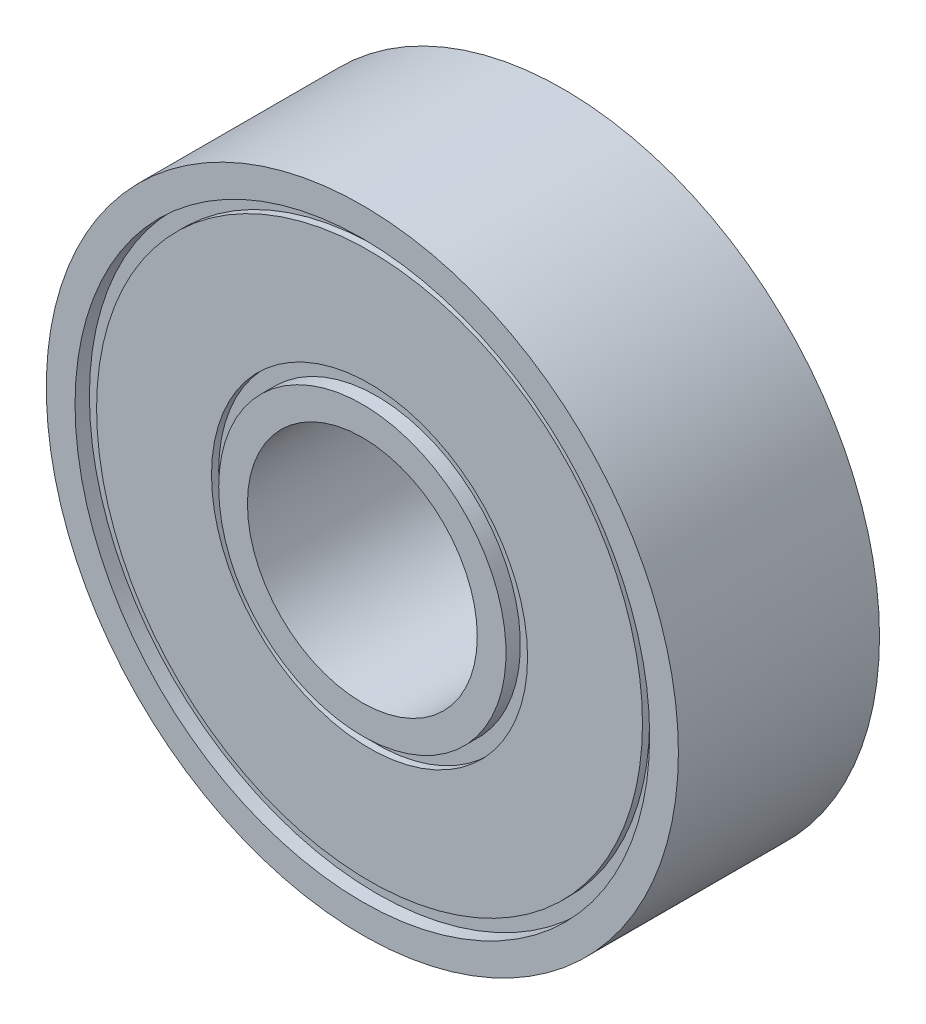
ISO-10303-21;
HEADER;
FILE_DESCRIPTION(('STEP AP214'),'2;1');
FILE_NAME('part.step','',(''),(''),'','','');
FILE_SCHEMA(('AUTOMOTIVE_DESIGN { 1 0 10303 214 1 1 1 1 }'));
ENDSEC;
DATA;
#1=APPLICATION_CONTEXT('core data for automotive mechanical design processes');
#2=APPLICATION_PROTOCOL_DEFINITION('international standard','automotive_design',2000,#1);
#3=PRODUCT_CONTEXT('',#1,'mechanical');
#4=PRODUCT('Part','Part','',(#3));
#5=PRODUCT_RELATED_PRODUCT_CATEGORY('part','',(#4));
#6=PRODUCT_DEFINITION_FORMATION('','',#4);
#7=PRODUCT_DEFINITION_CONTEXT('part definition',#1,'design');
#8=PRODUCT_DEFINITION('design','',#6,#7);
#9=PRODUCT_DEFINITION_SHAPE('','',#8);
#10=(LENGTH_UNIT() NAMED_UNIT(*) SI_UNIT(.MILLI.,.METRE.));
#11=(NAMED_UNIT(*) PLANE_ANGLE_UNIT() SI_UNIT($,.RADIAN.));
#12=(NAMED_UNIT(*) SI_UNIT($,.STERADIAN.) SOLID_ANGLE_UNIT());
#13=UNCERTAINTY_MEASURE_WITH_UNIT(LENGTH_MEASURE(1.E-05),#10,'distance_accuracy_value','');
#14=(GEOMETRIC_REPRESENTATION_CONTEXT(3) GLOBAL_UNCERTAINTY_ASSIGNED_CONTEXT((#13)) GLOBAL_UNIT_ASSIGNED_CONTEXT((#10,
#11,#12)) REPRESENTATION_CONTEXT('',''));
#15=CARTESIAN_POINT('',(0.,0.,0.));
#16=DIRECTION('',(0.,0.,1.));
#17=DIRECTION('',(1.,0.,0.));
#18=AXIS2_PLACEMENT_3D('',#15,#16,#17);
#19=CARTESIAN_POINT('',(0.,0.,0.));
#20=DIRECTION('',(0.,0.,1.));
#21=DIRECTION('',(1.,0.,0.));
#22=AXIS2_PLACEMENT_3D('',#19,#20,#21);
#23=PLANE('',#22);
#24=CARTESIAN_POINT('',(0.,0.,0.));
#25=DIRECTION('',(0.,0.,1.));
#26=DIRECTION('',(1.,0.,0.));
#27=AXIS2_PLACEMENT_3D('',#24,#25,#26);
#28=CIRCLE('',#27,11.);
#29=CARTESIAN_POINT('',(11.,0.,0.));
#30=VERTEX_POINT('',#29);
#31=EDGE_CURVE('E10',#30,#30,#28,.T.);
#32=ORIENTED_EDGE('',*,*,#31,.F.);
#33=EDGE_LOOP('',(#32));
#34=FACE_BOUND('',#33,.T.);
#35=CARTESIAN_POINT('',(0.,0.,0.));
#36=DIRECTION('',(0.,0.,-1.));
#37=DIRECTION('',(-1.,0.,0.));
#38=AXIS2_PLACEMENT_3D('',#35,#36,#37);
#39=CIRCLE('',#38,10.);
#40=CARTESIAN_POINT('',(-10.,0.,0.));
#41=VERTEX_POINT('',#40);
#42=EDGE_CURVE('E95',#41,#41,#39,.T.);
#43=ORIENTED_EDGE('',*,*,#42,.F.);
#44=EDGE_LOOP('',(#43));
#45=FACE_BOUND('',#44,.T.);
#46=ADVANCED_FACE('F30',(#34,#45),#23,.F.);
#47=CARTESIAN_POINT('',(0.,0.,0.));
#48=DIRECTION('',(0.,0.,1.));
#49=DIRECTION('',(1.,0.,0.));
#50=AXIS2_PLACEMENT_3D('',#47,#48,#49);
#51=CIRCLE('',#50,4.);
#52=CARTESIAN_POINT('',(4.,0.,0.));
#53=VERTEX_POINT('',#52);
#54=EDGE_CURVE('E47',#53,#53,#51,.F.);
#55=ORIENTED_EDGE('',*,*,#54,.F.);
#56=EDGE_LOOP('',(#55));
#57=FACE_BOUND('',#56,.T.);
#58=CARTESIAN_POINT('',(0.,0.,0.));
#59=DIRECTION('',(0.,0.,-1.));
#60=DIRECTION('',(-1.,0.,0.));
#61=AXIS2_PLACEMENT_3D('',#58,#59,#60);
#62=CIRCLE('',#61,5.);
#63=CARTESIAN_POINT('',(-5.,0.,0.));
#64=VERTEX_POINT('',#63);
#65=EDGE_CURVE('E121',#64,#64,#62,.T.);
#66=ORIENTED_EDGE('',*,*,#65,.T.);
#67=EDGE_LOOP('',(#66));
#68=FACE_BOUND('',#67,.T.);
#69=ADVANCED_FACE('F125',(#57,#68),#23,.F.);
#70=CARTESIAN_POINT('',(0.,0.,7.));
#71=DIRECTION('',(0.,0.,1.));
#72=DIRECTION('',(1.,0.,0.));
#73=AXIS2_PLACEMENT_3D('',#70,#71,#72);
#74=PLANE('',#73);
#75=CARTESIAN_POINT('',(0.,0.,7.));
#76=DIRECTION('',(0.,0.,1.));
#77=DIRECTION('',(1.,0.,0.));
#78=AXIS2_PLACEMENT_3D('',#75,#76,#77);
#79=CIRCLE('',#78,11.);
#80=CARTESIAN_POINT('',(11.,0.,7.));
#81=VERTEX_POINT('',#80);
#82=EDGE_CURVE('E39',#81,#81,#79,.F.);
#83=ORIENTED_EDGE('',*,*,#82,.F.);
#84=EDGE_LOOP('',(#83));
#85=FACE_BOUND('',#84,.T.);
#86=CARTESIAN_POINT('',(0.,0.,7.));
#87=DIRECTION('',(0.,0.,-1.));
#88=DIRECTION('',(-1.,0.,0.));
#89=AXIS2_PLACEMENT_3D('',#86,#87,#88);
#90=CIRCLE('',#89,10.);
#91=CARTESIAN_POINT('',(-10.,0.,7.));
#92=VERTEX_POINT('',#91);
#93=EDGE_CURVE('E50',#92,#92,#90,.T.);
#94=ORIENTED_EDGE('',*,*,#93,.T.);
#95=EDGE_LOOP('',(#94));
#96=FACE_BOUND('',#95,.T.);
#97=ADVANCED_FACE('F144',(#85,#96),#74,.T.);
#98=CARTESIAN_POINT('',(0.,0.,7.));
#99=DIRECTION('',(0.,0.,1.));
#100=DIRECTION('',(1.,0.,0.));
#101=AXIS2_PLACEMENT_3D('',#98,#99,#100);
#102=CIRCLE('',#101,4.);
#103=CARTESIAN_POINT('',(4.,0.,7.));
#104=VERTEX_POINT('',#103);
#105=EDGE_CURVE('E34',#104,#104,#102,.F.);
#106=ORIENTED_EDGE('',*,*,#105,.T.);
#107=EDGE_LOOP('',(#106));
#108=FACE_BOUND('',#107,.T.);
#109=CARTESIAN_POINT('',(0.,0.,7.));
#110=DIRECTION('',(0.,0.,-1.));
#111=DIRECTION('',(-1.,0.,0.));
#112=AXIS2_PLACEMENT_3D('',#109,#110,#111);
#113=CIRCLE('',#112,5.);
#114=CARTESIAN_POINT('',(-5.,0.,7.));
#115=VERTEX_POINT('',#114);
#116=EDGE_CURVE('E91',#115,#115,#113,.T.);
#117=ORIENTED_EDGE('',*,*,#116,.F.);
#118=EDGE_LOOP('',(#117));
#119=FACE_BOUND('',#118,.T.);
#120=ADVANCED_FACE('F151',(#108,#119),#74,.T.);
#121=CARTESIAN_POINT('',(0.,0.,0.));
#122=DIRECTION('',(0.,0.,1.));
#123=DIRECTION('',(1.,0.,0.));
#124=AXIS2_PLACEMENT_3D('',#121,#122,#123);
#125=CYLINDRICAL_SURFACE('',#124,4.);
#126=ORIENTED_EDGE('',*,*,#54,.T.);
#127=EDGE_LOOP('',(#126));
#128=FACE_BOUND('',#127,.T.);
#129=ORIENTED_EDGE('',*,*,#105,.F.);
#130=EDGE_LOOP('',(#129));
#131=FACE_BOUND('',#130,.T.);
#132=ADVANCED_FACE('F32',(#128,#131),#125,.F.);
#133=CARTESIAN_POINT('',(0.,0.,0.));
#134=DIRECTION('',(0.,0.,1.));
#135=DIRECTION('',(1.,0.,0.));
#136=AXIS2_PLACEMENT_3D('',#133,#134,#135);
#137=CYLINDRICAL_SURFACE('',#136,11.);
#138=ORIENTED_EDGE('',*,*,#31,.T.);
#139=EDGE_LOOP('',(#138));
#140=FACE_BOUND('',#139,.T.);
#141=ORIENTED_EDGE('',*,*,#82,.T.);
#142=EDGE_LOOP('',(#141));
#143=FACE_BOUND('',#142,.T.);
#144=ADVANCED_FACE('F148',(#140,#143),#137,.T.);
#145=CARTESIAN_POINT('',(0.,0.,0.));
#146=DIRECTION('',(0.,0.,-1.));
#147=DIRECTION('',(-1.,0.,0.));
#148=AXIS2_PLACEMENT_3D('',#145,#146,#147);
#149=CYLINDRICAL_SURFACE('',#148,10.);
#150=CARTESIAN_POINT('',(0.,0.,6.5));
#151=DIRECTION('',(0.,0.,-1.));
#152=DIRECTION('',(-1.,0.,0.));
#153=AXIS2_PLACEMENT_3D('',#150,#151,#152);
#154=CIRCLE('',#153,10.);
#155=CARTESIAN_POINT('',(-10.,0.,6.5));
#156=VERTEX_POINT('',#155);
#157=EDGE_CURVE('E65',#156,#156,#154,.T.);
#158=ORIENTED_EDGE('',*,*,#157,.T.);
#159=EDGE_LOOP('',(#158));
#160=FACE_BOUND('',#159,.T.);
#161=ORIENTED_EDGE('',*,*,#93,.F.);
#162=EDGE_LOOP('',(#161));
#163=FACE_BOUND('',#162,.T.);
#164=ADVANCED_FACE('F159',(#160,#163),#149,.F.);
#165=CARTESIAN_POINT('',(10.,0.,6.5));
#166=DIRECTION('',(0.,0.,1.));
#167=DIRECTION('',(1.,0.,0.));
#168=AXIS2_PLACEMENT_3D('',#165,#166,#167);
#169=PLANE('',#168);
#170=CARTESIAN_POINT('',(0.,0.,6.5));
#171=DIRECTION('',(0.,0.,-1.));
#172=DIRECTION('',(-1.,0.,0.));
#173=AXIS2_PLACEMENT_3D('',#170,#171,#172);
#174=CIRCLE('',#173,9.5);
#175=CARTESIAN_POINT('',(-9.5,0.,6.5));
#176=VERTEX_POINT('',#175);
#177=EDGE_CURVE('E70',#176,#176,#174,.T.);
#178=ORIENTED_EDGE('',*,*,#177,.T.);
#179=EDGE_LOOP('',(#178));
#180=FACE_BOUND('',#179,.T.);
#181=ORIENTED_EDGE('',*,*,#157,.F.);
#182=EDGE_LOOP('',(#181));
#183=FACE_BOUND('',#182,.T.);
#184=ADVANCED_FACE('F164',(#180,#183),#169,.T.);
#185=CARTESIAN_POINT('',(0.,0.,0.));
#186=DIRECTION('',(0.,0.,-1.));
#187=DIRECTION('',(-1.,0.,0.));
#188=AXIS2_PLACEMENT_3D('',#185,#186,#187);
#189=CYLINDRICAL_SURFACE('',#188,9.5);
#190=CARTESIAN_POINT('',(0.,0.,6.75));
#191=DIRECTION('',(0.,0.,-1.));
#192=DIRECTION('',(-1.,0.,0.));
#193=AXIS2_PLACEMENT_3D('',#190,#191,#192);
#194=CIRCLE('',#193,9.5);
#195=CARTESIAN_POINT('',(-9.5,0.,6.75));
#196=VERTEX_POINT('',#195);
#197=EDGE_CURVE('E77',#196,#196,#194,.T.);
#198=ORIENTED_EDGE('',*,*,#197,.T.);
#199=EDGE_LOOP('',(#198));
#200=FACE_BOUND('',#199,.T.);
#201=ORIENTED_EDGE('',*,*,#177,.F.);
#202=EDGE_LOOP('',(#201));
#203=FACE_BOUND('',#202,.T.);
#204=ADVANCED_FACE('F192',(#200,#203),#189,.T.);
#205=CARTESIAN_POINT('',(9.5,0.,6.75));
#206=DIRECTION('',(0.,0.,1.));
#207=DIRECTION('',(1.,0.,0.));
#208=AXIS2_PLACEMENT_3D('',#205,#206,#207);
#209=PLANE('',#208);
#210=CARTESIAN_POINT('',(0.,0.,6.75));
#211=DIRECTION('',(0.,0.,-1.));
#212=DIRECTION('',(-1.,0.,0.));
#213=AXIS2_PLACEMENT_3D('',#210,#211,#212);
#214=CIRCLE('',#213,5.5);
#215=CARTESIAN_POINT('',(-5.5,0.,6.75));
#216=VERTEX_POINT('',#215);
#217=EDGE_CURVE('E82',#216,#216,#214,.T.);
#218=ORIENTED_EDGE('',*,*,#217,.T.);
#219=EDGE_LOOP('',(#218));
#220=FACE_BOUND('',#219,.T.);
#221=ORIENTED_EDGE('',*,*,#197,.F.);
#222=EDGE_LOOP('',(#221));
#223=FACE_BOUND('',#222,.T.);
#224=ADVANCED_FACE('F202',(#220,#223),#209,.T.);
#225=CARTESIAN_POINT('',(0.,0.,0.));
#226=DIRECTION('',(0.,0.,-1.));
#227=DIRECTION('',(-1.,0.,0.));
#228=AXIS2_PLACEMENT_3D('',#225,#226,#227);
#229=CYLINDRICAL_SURFACE('',#228,5.5);
#230=CARTESIAN_POINT('',(0.,0.,6.5));
#231=DIRECTION('',(0.,0.,-1.));
#232=DIRECTION('',(-1.,0.,0.));
#233=AXIS2_PLACEMENT_3D('',#230,#231,#232);
#234=CIRCLE('',#233,5.5);
#235=CARTESIAN_POINT('',(-5.5,0.,6.5));
#236=VERTEX_POINT('',#235);
#237=EDGE_CURVE('E85',#236,#236,#234,.T.);
#238=ORIENTED_EDGE('',*,*,#237,.T.);
#239=EDGE_LOOP('',(#238));
#240=FACE_BOUND('',#239,.T.);
#241=ORIENTED_EDGE('',*,*,#217,.F.);
#242=EDGE_LOOP('',(#241));
#243=FACE_BOUND('',#242,.T.);
#244=ADVANCED_FACE('F212',(#240,#243),#229,.F.);
#245=CARTESIAN_POINT('',(5.5,0.,6.5));
#246=DIRECTION('',(0.,0.,1.));
#247=DIRECTION('',(1.,0.,0.));
#248=AXIS2_PLACEMENT_3D('',#245,#246,#247);
#249=PLANE('',#248);
#250=CARTESIAN_POINT('',(0.,0.,6.5));
#251=DIRECTION('',(0.,0.,-1.));
#252=DIRECTION('',(-1.,0.,0.));
#253=AXIS2_PLACEMENT_3D('',#250,#251,#252);
#254=CIRCLE('',#253,5.);
#255=CARTESIAN_POINT('',(-5.,0.,6.5));
#256=VERTEX_POINT('',#255);
#257=EDGE_CURVE('E88',#256,#256,#254,.T.);
#258=ORIENTED_EDGE('',*,*,#257,.T.);
#259=EDGE_LOOP('',(#258));
#260=FACE_BOUND('',#259,.T.);
#261=ORIENTED_EDGE('',*,*,#237,.F.);
#262=EDGE_LOOP('',(#261));
#263=FACE_BOUND('',#262,.T.);
#264=ADVANCED_FACE('F222',(#260,#263),#249,.T.);
#265=CARTESIAN_POINT('',(0.,0.,0.));
#266=DIRECTION('',(0.,0.,-1.));
#267=DIRECTION('',(-1.,0.,0.));
#268=AXIS2_PLACEMENT_3D('',#265,#266,#267);
#269=CYLINDRICAL_SURFACE('',#268,5.);
#270=ORIENTED_EDGE('',*,*,#116,.T.);
#271=EDGE_LOOP('',(#270));
#272=FACE_BOUND('',#271,.T.);
#273=ORIENTED_EDGE('',*,*,#257,.F.);
#274=EDGE_LOOP('',(#273));
#275=FACE_BOUND('',#274,.T.);
#276=ADVANCED_FACE('F232',(#272,#275),#269,.T.);
#277=CARTESIAN_POINT('',(0.,0.,0.));
#278=DIRECTION('',(0.,0.,-1.));
#279=DIRECTION('',(-1.,0.,0.));
#280=AXIS2_PLACEMENT_3D('',#277,#278,#279);
#281=CYLINDRICAL_SURFACE('',#280,10.);
#282=ORIENTED_EDGE('',*,*,#42,.T.);
#283=EDGE_LOOP('',(#282));
#284=FACE_BOUND('',#283,.T.);
#285=CARTESIAN_POINT('',(0.,0.,0.500000000000001));
#286=DIRECTION('',(0.,0.,-1.));
#287=DIRECTION('',(-1.,0.,0.));
#288=AXIS2_PLACEMENT_3D('',#285,#286,#287);
#289=CIRCLE('',#288,10.);
#290=CARTESIAN_POINT('',(-10.,0.,0.500000000000001));
#291=VERTEX_POINT('',#290);
#292=EDGE_CURVE('E98',#291,#291,#289,.T.);
#293=ORIENTED_EDGE('',*,*,#292,.F.);
#294=EDGE_LOOP('',(#293));
#295=FACE_BOUND('',#294,.T.);
#296=ADVANCED_FACE('F242',(#284,#295),#281,.F.);
#297=CARTESIAN_POINT('',(10.,0.,0.500000000000001));
#298=DIRECTION('',(0.,0.,-1.));
#299=DIRECTION('',(-1.,0.,0.));
#300=AXIS2_PLACEMENT_3D('',#297,#298,#299);
#301=PLANE('',#300);
#302=ORIENTED_EDGE('',*,*,#292,.T.);
#303=EDGE_LOOP('',(#302));
#304=FACE_BOUND('',#303,.T.);
#305=CARTESIAN_POINT('',(0.,0.,0.500000000000001));
#306=DIRECTION('',(0.,0.,-1.));
#307=DIRECTION('',(-1.,0.,0.));
#308=AXIS2_PLACEMENT_3D('',#305,#306,#307);
#309=CIRCLE('',#308,9.5);
#310=CARTESIAN_POINT('',(-9.5,0.,0.500000000000001));
#311=VERTEX_POINT('',#310);
#312=EDGE_CURVE('E102',#311,#311,#309,.T.);
#313=ORIENTED_EDGE('',*,*,#312,.F.);
#314=EDGE_LOOP('',(#313));
#315=FACE_BOUND('',#314,.T.);
#316=ADVANCED_FACE('F252',(#304,#315),#301,.T.);
#317=CARTESIAN_POINT('',(0.,0.,0.));
#318=DIRECTION('',(0.,0.,-1.));
#319=DIRECTION('',(-1.,0.,0.));
#320=AXIS2_PLACEMENT_3D('',#317,#318,#319);
#321=CYLINDRICAL_SURFACE('',#320,9.5);
#322=ORIENTED_EDGE('',*,*,#312,.T.);
#323=EDGE_LOOP('',(#322));
#324=FACE_BOUND('',#323,.T.);
#325=CARTESIAN_POINT('',(0.,0.,0.249999999999999));
#326=DIRECTION('',(0.,0.,-1.));
#327=DIRECTION('',(-1.,0.,0.));
#328=AXIS2_PLACEMENT_3D('',#325,#326,#327);
#329=CIRCLE('',#328,9.5);
#330=CARTESIAN_POINT('',(-9.5,0.,0.249999999999999));
#331=VERTEX_POINT('',#330);
#332=EDGE_CURVE('E106',#331,#331,#329,.T.);
#333=ORIENTED_EDGE('',*,*,#332,.F.);
#334=EDGE_LOOP('',(#333));
#335=FACE_BOUND('',#334,.T.);
#336=ADVANCED_FACE('F262',(#324,#335),#321,.T.);
#337=CARTESIAN_POINT('',(9.5,0.,0.249999999999999));
#338=DIRECTION('',(0.,0.,-1.));
#339=DIRECTION('',(-1.,0.,0.));
#340=AXIS2_PLACEMENT_3D('',#337,#338,#339);
#341=PLANE('',#340);
#342=ORIENTED_EDGE('',*,*,#332,.T.);
#343=EDGE_LOOP('',(#342));
#344=FACE_BOUND('',#343,.T.);
#345=CARTESIAN_POINT('',(0.,0.,0.249999999999999));
#346=DIRECTION('',(0.,0.,-1.));
#347=DIRECTION('',(-1.,0.,0.));
#348=AXIS2_PLACEMENT_3D('',#345,#346,#347);
#349=CIRCLE('',#348,5.5);
#350=CARTESIAN_POINT('',(-5.5,0.,0.249999999999999));
#351=VERTEX_POINT('',#350);
#352=EDGE_CURVE('E109',#351,#351,#349,.T.);
#353=ORIENTED_EDGE('',*,*,#352,.F.);
#354=EDGE_LOOP('',(#353));
#355=FACE_BOUND('',#354,.T.);
#356=ADVANCED_FACE('F272',(#344,#355),#341,.T.);
#357=CARTESIAN_POINT('',(0.,0.,0.));
#358=DIRECTION('',(0.,0.,-1.));
#359=DIRECTION('',(-1.,0.,0.));
#360=AXIS2_PLACEMENT_3D('',#357,#358,#359);
#361=CYLINDRICAL_SURFACE('',#360,5.5);
#362=ORIENTED_EDGE('',*,*,#352,.T.);
#363=EDGE_LOOP('',(#362));
#364=FACE_BOUND('',#363,.T.);
#365=CARTESIAN_POINT('',(0.,0.,0.500000000000001));
#366=DIRECTION('',(0.,0.,-1.));
#367=DIRECTION('',(-1.,0.,0.));
#368=AXIS2_PLACEMENT_3D('',#365,#366,#367);
#369=CIRCLE('',#368,5.5);
#370=CARTESIAN_POINT('',(-5.5,0.,0.500000000000001));
#371=VERTEX_POINT('',#370);
#372=EDGE_CURVE('E113',#371,#371,#369,.T.);
#373=ORIENTED_EDGE('',*,*,#372,.F.);
#374=EDGE_LOOP('',(#373));
#375=FACE_BOUND('',#374,.T.);
#376=ADVANCED_FACE('F135',(#364,#375),#361,.F.);
#377=CARTESIAN_POINT('',(5.5,0.,0.500000000000001));
#378=DIRECTION('',(0.,0.,-1.));
#379=DIRECTION('',(-1.,0.,0.));
#380=AXIS2_PLACEMENT_3D('',#377,#378,#379);
#381=PLANE('',#380);
#382=ORIENTED_EDGE('',*,*,#372,.T.);
#383=EDGE_LOOP('',(#382));
#384=FACE_BOUND('',#383,.T.);
#385=CARTESIAN_POINT('',(0.,0.,0.500000000000001));
#386=DIRECTION('',(0.,0.,-1.));
#387=DIRECTION('',(-1.,0.,0.));
#388=AXIS2_PLACEMENT_3D('',#385,#386,#387);
#389=CIRCLE('',#388,5.);
#390=CARTESIAN_POINT('',(-5.,0.,0.500000000000001));
#391=VERTEX_POINT('',#390);
#392=EDGE_CURVE('E117',#391,#391,#389,.T.);
#393=ORIENTED_EDGE('',*,*,#392,.F.);
#394=EDGE_LOOP('',(#393));
#395=FACE_BOUND('',#394,.T.);
#396=ADVANCED_FACE('F129',(#384,#395),#381,.T.);
#397=CARTESIAN_POINT('',(0.,0.,0.));
#398=DIRECTION('',(0.,0.,-1.));
#399=DIRECTION('',(-1.,0.,0.));
#400=AXIS2_PLACEMENT_3D('',#397,#398,#399);
#401=CYLINDRICAL_SURFACE('',#400,5.);
#402=ORIENTED_EDGE('',*,*,#392,.T.);
#403=EDGE_LOOP('',(#402));
#404=FACE_BOUND('',#403,.T.);
#405=ORIENTED_EDGE('',*,*,#65,.F.);
#406=EDGE_LOOP('',(#405));
#407=FACE_BOUND('',#406,.T.);
#408=ADVANCED_FACE('F127',(#404,#407),#401,.T.);
#409=CLOSED_SHELL('',(#46,#69,#97,#120,#132,#144,#164,#184,#204,#224,#244,#264,#276,#296,#316,
#336,#356,#376,#396,#408));
#410=MANIFOLD_SOLID_BREP('B2',#409);
#411=ADVANCED_BREP_SHAPE_REPRESENTATION('',(#18,#410),#14);
#412=SHAPE_DEFINITION_REPRESENTATION(#9,#411);
ENDSEC;
END-ISO-10303-21;
